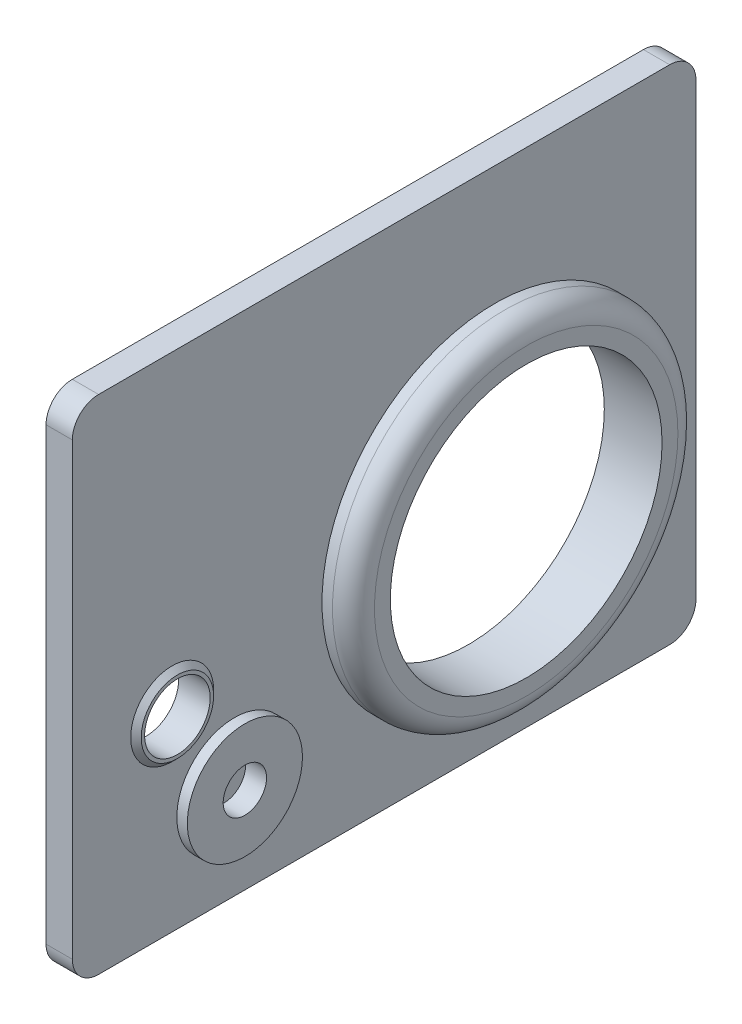
ISO-10303-21;
HEADER;
FILE_DESCRIPTION(('STEP AP214'),'2;1');
FILE_NAME('part.step','',(''),(''),'','','');
FILE_SCHEMA(('AUTOMOTIVE_DESIGN { 1 0 10303 214 1 1 1 1 }'));
ENDSEC;
DATA;
#1=APPLICATION_CONTEXT('core data for automotive mechanical design processes');
#2=APPLICATION_PROTOCOL_DEFINITION('international standard','automotive_design',2000,#1);
#3=PRODUCT_CONTEXT('',#1,'mechanical');
#4=PRODUCT('Part','Part','',(#3));
#5=PRODUCT_RELATED_PRODUCT_CATEGORY('part','',(#4));
#6=PRODUCT_DEFINITION_FORMATION('','',#4);
#7=PRODUCT_DEFINITION_CONTEXT('part definition',#1,'design');
#8=PRODUCT_DEFINITION('design','',#6,#7);
#9=PRODUCT_DEFINITION_SHAPE('','',#8);
#10=(LENGTH_UNIT() NAMED_UNIT(*) SI_UNIT(.MILLI.,.METRE.));
#11=(NAMED_UNIT(*) PLANE_ANGLE_UNIT() SI_UNIT($,.RADIAN.));
#12=(NAMED_UNIT(*) SI_UNIT($,.STERADIAN.) SOLID_ANGLE_UNIT());
#13=UNCERTAINTY_MEASURE_WITH_UNIT(LENGTH_MEASURE(1.E-05),#10,'distance_accuracy_value','');
#14=(GEOMETRIC_REPRESENTATION_CONTEXT(3) GLOBAL_UNCERTAINTY_ASSIGNED_CONTEXT((#13)) GLOBAL_UNIT_ASSIGNED_CONTEXT((#10,
#11,#12)) REPRESENTATION_CONTEXT('',''));
#15=CARTESIAN_POINT('',(0.,0.,0.));
#16=DIRECTION('',(0.,0.,1.));
#17=DIRECTION('',(1.,0.,0.));
#18=AXIS2_PLACEMENT_3D('',#15,#16,#17);
#19=CARTESIAN_POINT('',(5.,-47.8186465873431,0.));
#20=DIRECTION('',(0.,1.,0.));
#21=DIRECTION('',(0.,0.,1.));
#22=AXIS2_PLACEMENT_3D('',#19,#20,#21);
#23=PLANE('',#22);
#24=DIRECTION('',(0.,0.,-1.));
#25=VECTOR('',#24,1.);
#26=CARTESIAN_POINT('',(0.,-47.8186465873431,0.));
#27=LINE('',#26,#25);
#28=CARTESIAN_POINT('',(0.,-47.8186465873431,54.3691641496964));
#29=VERTEX_POINT('',#28);
#30=CARTESIAN_POINT('',(0.,-47.8186465873431,-54.3691641496964));
#31=VERTEX_POINT('',#30);
#32=EDGE_CURVE('E169',#29,#31,#27,.T.);
#33=ORIENTED_EDGE('',*,*,#32,.T.);
#34=DIRECTION('',(-1.,0.,0.));
#35=VECTOR('',#34,1.);
#36=CARTESIAN_POINT('',(5.,-47.8186465873431,-54.3691641496964));
#37=LINE('',#36,#35);
#38=CARTESIAN_POINT('',(5.,-47.8186465873431,-54.3691641496964));
#39=VERTEX_POINT('',#38);
#40=EDGE_CURVE('E154',#31,#39,#37,.F.);
#41=ORIENTED_EDGE('',*,*,#40,.T.);
#42=DIRECTION('',(0.,0.,-1.));
#43=VECTOR('',#42,1.);
#44=CARTESIAN_POINT('',(5.,-47.8186465873431,0.));
#45=LINE('',#44,#43);
#46=CARTESIAN_POINT('',(5.,-47.8186465873431,54.3691641496964));
#47=VERTEX_POINT('',#46);
#48=EDGE_CURVE('E212',#47,#39,#45,.T.);
#49=ORIENTED_EDGE('',*,*,#48,.F.);
#50=DIRECTION('',(-1.,0.,0.));
#51=VECTOR('',#50,1.);
#52=CARTESIAN_POINT('',(0.,-47.8186465873431,54.3691641496964));
#53=LINE('',#52,#51);
#54=EDGE_CURVE('E151',#47,#29,#53,.T.);
#55=ORIENTED_EDGE('',*,*,#54,.T.);
#56=EDGE_LOOP('',(#33,#41,#49,#55));
#57=FACE_BOUND('',#56,.T.);
#58=ADVANCED_FACE('F39',(#57),#23,.F.);
#59=CARTESIAN_POINT('',(5.,0.,-59.3691641496964));
#60=DIRECTION('',(0.,0.,1.));
#61=DIRECTION('',(1.,0.,0.));
#62=AXIS2_PLACEMENT_3D('',#59,#60,#61);
#63=PLANE('',#62);
#64=DIRECTION('',(0.,1.,0.));
#65=VECTOR('',#64,1.);
#66=CARTESIAN_POINT('',(0.,0.,-59.3691641496964));
#67=LINE('',#66,#65);
#68=CARTESIAN_POINT('',(0.,-42.8186465873431,-59.3691641496964));
#69=VERTEX_POINT('',#68);
#70=CARTESIAN_POINT('',(0.,42.8186465873431,-59.3691641496964));
#71=VERTEX_POINT('',#70);
#72=EDGE_CURVE('E124',#69,#71,#67,.T.);
#73=ORIENTED_EDGE('',*,*,#72,.T.);
#74=DIRECTION('',(-1.,0.,0.));
#75=VECTOR('',#74,1.);
#76=CARTESIAN_POINT('',(5.,42.8186465873431,-59.3691641496964));
#77=LINE('',#76,#75);
#78=CARTESIAN_POINT('',(5.,42.8186465873431,-59.3691641496964));
#79=VERTEX_POINT('',#78);
#80=EDGE_CURVE('E142',#71,#79,#77,.F.);
#81=ORIENTED_EDGE('',*,*,#80,.T.);
#82=DIRECTION('',(0.,1.,0.));
#83=VECTOR('',#82,1.);
#84=CARTESIAN_POINT('',(5.,0.,-59.3691641496964));
#85=LINE('',#84,#83);
#86=CARTESIAN_POINT('',(5.,-42.8186465873431,-59.3691641496964));
#87=VERTEX_POINT('',#86);
#88=EDGE_CURVE('E165',#87,#79,#85,.T.);
#89=ORIENTED_EDGE('',*,*,#88,.F.);
#90=DIRECTION('',(-1.,0.,0.));
#91=VECTOR('',#90,1.);
#92=CARTESIAN_POINT('',(5.,-42.8186465873431,-59.3691641496964));
#93=LINE('',#92,#91);
#94=EDGE_CURVE('E139',#87,#69,#93,.T.);
#95=ORIENTED_EDGE('',*,*,#94,.T.);
#96=EDGE_LOOP('',(#73,#81,#89,#95));
#97=FACE_BOUND('',#96,.T.);
#98=ADVANCED_FACE('F225',(#97),#63,.F.);
#99=CARTESIAN_POINT('',(5.,47.8186465873431,0.));
#100=DIRECTION('',(0.,1.,0.));
#101=DIRECTION('',(0.,0.,1.));
#102=AXIS2_PLACEMENT_3D('',#99,#100,#101);
#103=PLANE('',#102);
#104=DIRECTION('',(0.,0.,-1.));
#105=VECTOR('',#104,1.);
#106=CARTESIAN_POINT('',(5.,47.8186465873431,0.));
#107=LINE('',#106,#105);
#108=CARTESIAN_POINT('',(5.,47.8186465873431,54.3691641496964));
#109=VERTEX_POINT('',#108);
#110=CARTESIAN_POINT('',(5.,47.8186465873431,-54.3691641496964));
#111=VERTEX_POINT('',#110);
#112=EDGE_CURVE('E161',#109,#111,#107,.T.);
#113=ORIENTED_EDGE('',*,*,#112,.T.);
#114=DIRECTION('',(-1.,0.,0.));
#115=VECTOR('',#114,1.);
#116=CARTESIAN_POINT('',(0.,47.8186465873431,-54.3691641496964));
#117=LINE('',#116,#115);
#118=CARTESIAN_POINT('',(0.,47.8186465873431,-54.3691641496964));
#119=VERTEX_POINT('',#118);
#120=EDGE_CURVE('E116',#111,#119,#117,.T.);
#121=ORIENTED_EDGE('',*,*,#120,.T.);
#122=DIRECTION('',(0.,0.,-1.));
#123=VECTOR('',#122,1.);
#124=CARTESIAN_POINT('',(0.,47.8186465873431,0.));
#125=LINE('',#124,#123);
#126=CARTESIAN_POINT('',(0.,47.8186465873431,54.3691641496964));
#127=VERTEX_POINT('',#126);
#128=EDGE_CURVE('E109',#127,#119,#125,.T.);
#129=ORIENTED_EDGE('',*,*,#128,.F.);
#130=DIRECTION('',(-1.,0.,0.));
#131=VECTOR('',#130,1.);
#132=CARTESIAN_POINT('',(5.,47.8186465873431,54.3691641496964));
#133=LINE('',#132,#131);
#134=EDGE_CURVE('E122',#127,#109,#133,.F.);
#135=ORIENTED_EDGE('',*,*,#134,.T.);
#136=EDGE_LOOP('',(#113,#121,#129,#135));
#137=FACE_BOUND('',#136,.T.);
#138=ADVANCED_FACE('F121',(#137),#103,.T.);
#139=CARTESIAN_POINT('',(5.,0.,59.3691641496964));
#140=DIRECTION('',(0.,0.,1.));
#141=DIRECTION('',(1.,0.,0.));
#142=AXIS2_PLACEMENT_3D('',#139,#140,#141);
#143=PLANE('',#142);
#144=DIRECTION('',(0.,1.,0.));
#145=VECTOR('',#144,1.);
#146=CARTESIAN_POINT('',(0.,0.,59.3691641496964));
#147=LINE('',#146,#145);
#148=CARTESIAN_POINT('',(0.,-42.8186465873431,59.3691641496964));
#149=VERTEX_POINT('',#148);
#150=CARTESIAN_POINT('',(0.,42.8186465873431,59.3691641496964));
#151=VERTEX_POINT('',#150);
#152=EDGE_CURVE('E110',#149,#151,#147,.T.);
#153=ORIENTED_EDGE('',*,*,#152,.F.);
#154=DIRECTION('',(-1.,0.,0.));
#155=VECTOR('',#154,1.);
#156=CARTESIAN_POINT('',(5.,-42.8186465873431,59.3691641496964));
#157=LINE('',#156,#155);
#158=CARTESIAN_POINT('',(5.,-42.8186465873431,59.3691641496964));
#159=VERTEX_POINT('',#158);
#160=EDGE_CURVE('E47',#149,#159,#157,.F.);
#161=ORIENTED_EDGE('',*,*,#160,.T.);
#162=DIRECTION('',(0.,1.,0.));
#163=VECTOR('',#162,1.);
#164=CARTESIAN_POINT('',(5.,0.,59.3691641496964));
#165=LINE('',#164,#163);
#166=CARTESIAN_POINT('',(5.,42.8186465873431,59.3691641496964));
#167=VERTEX_POINT('',#166);
#168=EDGE_CURVE('E158',#159,#167,#165,.T.);
#169=ORIENTED_EDGE('',*,*,#168,.T.);
#170=DIRECTION('',(-1.,0.,0.));
#171=VECTOR('',#170,1.);
#172=CARTESIAN_POINT('',(5.,42.8186465873431,59.3691641496964));
#173=LINE('',#172,#171);
#174=EDGE_CURVE('E156',#167,#151,#173,.T.);
#175=ORIENTED_EDGE('',*,*,#174,.T.);
#176=EDGE_LOOP('',(#153,#161,#169,#175));
#177=FACE_BOUND('',#176,.T.);
#178=ADVANCED_FACE('F157',(#177),#143,.T.);
#179=CARTESIAN_POINT('',(5.,0.,0.));
#180=DIRECTION('',(1.,0.,0.));
#181=DIRECTION('',(0.,0.,-1.));
#182=AXIS2_PLACEMENT_3D('',#179,#180,#181);
#183=PLANE('',#182);
#184=CARTESIAN_POINT('',(5.,-11.8260503050656,40.36330842923));
#185=DIRECTION('',(1.,0.,0.));
#186=DIRECTION('',(0.,0.,-1.));
#187=AXIS2_PLACEMENT_3D('',#184,#185,#186);
#188=CIRCLE('',#187,7.89482941746761);
#189=CARTESIAN_POINT('',(5.,-11.8260503050656,32.4684790117624));
#190=VERTEX_POINT('',#189);
#191=EDGE_CURVE('E175',#190,#190,#188,.T.);
#192=ORIENTED_EDGE('',*,*,#191,.F.);
#193=EDGE_LOOP('',(#192));
#194=FACE_BOUND('',#193,.T.);
#195=CARTESIAN_POINT('',(5.,-29.366301205693,28.5136729808346));
#196=DIRECTION('',(1.,0.,0.));
#197=DIRECTION('',(0.,0.,-1.));
#198=AXIS2_PLACEMENT_3D('',#195,#196,#197);
#199=CIRCLE('',#198,10.9631180729096);
#200=CARTESIAN_POINT('',(5.,-29.366301205693,17.5505549079249));
#201=VERTEX_POINT('',#200);
#202=EDGE_CURVE('E206',#201,#201,#199,.T.);
#203=ORIENTED_EDGE('',*,*,#202,.F.);
#204=EDGE_LOOP('',(#203));
#205=FACE_BOUND('',#204,.T.);
#206=CARTESIAN_POINT('',(5.,-7.78250118211528,-21.052704773187));
#207=DIRECTION('',(1.,0.,0.));
#208=DIRECTION('',(0.,0.,-1.));
#209=AXIS2_PLACEMENT_3D('',#206,#207,#208);
#210=CIRCLE('',#209,32.8876083466299);
#211=CARTESIAN_POINT('',(5.,-7.78250118211528,-53.9403131198169));
#212=VERTEX_POINT('',#211);
#213=EDGE_CURVE('E209',#212,#212,#210,.T.);
#214=ORIENTED_EDGE('',*,*,#213,.F.);
#215=EDGE_LOOP('',(#214));
#216=FACE_BOUND('',#215,.T.);
#217=ORIENTED_EDGE('',*,*,#88,.T.);
#218=CARTESIAN_POINT('',(5.,42.8186465873431,-54.3691641496964));
#219=DIRECTION('',(1.,0.,0.));
#220=DIRECTION('',(0.,0.,-1.));
#221=AXIS2_PLACEMENT_3D('',#218,#219,#220);
#222=CIRCLE('',#221,5.);
#223=EDGE_CURVE('E149',#79,#111,#222,.T.);
#224=ORIENTED_EDGE('',*,*,#223,.T.);
#225=ORIENTED_EDGE('',*,*,#112,.F.);
#226=CARTESIAN_POINT('',(5.,42.8186465873431,54.3691641496964));
#227=DIRECTION('',(1.,0.,0.));
#228=DIRECTION('',(0.,0.,-1.));
#229=AXIS2_PLACEMENT_3D('',#226,#227,#228);
#230=CIRCLE('',#229,5.);
#231=EDGE_CURVE('E54',#109,#167,#230,.T.);
#232=ORIENTED_EDGE('',*,*,#231,.T.);
#233=ORIENTED_EDGE('',*,*,#168,.F.);
#234=CARTESIAN_POINT('',(5.,-42.8186465873431,54.3691641496964));
#235=DIRECTION('',(1.,0.,0.));
#236=DIRECTION('',(0.,0.,-1.));
#237=AXIS2_PLACEMENT_3D('',#234,#235,#236);
#238=CIRCLE('',#237,5.);
#239=EDGE_CURVE('E145',#159,#47,#238,.T.);
#240=ORIENTED_EDGE('',*,*,#239,.T.);
#241=ORIENTED_EDGE('',*,*,#48,.T.);
#242=CARTESIAN_POINT('',(5.,-42.8186465873431,-54.3691641496964));
#243=DIRECTION('',(1.,0.,0.));
#244=DIRECTION('',(0.,0.,-1.));
#245=AXIS2_PLACEMENT_3D('',#242,#243,#244);
#246=CIRCLE('',#245,5.);
#247=EDGE_CURVE('E147',#39,#87,#246,.T.);
#248=ORIENTED_EDGE('',*,*,#247,.T.);
#249=EDGE_LOOP('',(#217,#224,#225,#232,#233,#240,#241,#248));
#250=FACE_BOUND('',#249,.T.);
#251=ADVANCED_FACE('F217',(#194,#205,#216,#250),#183,.T.);
#252=CARTESIAN_POINT('',(0.,0.,0.));
#253=DIRECTION('',(1.,0.,0.));
#254=DIRECTION('',(0.,0.,-1.));
#255=AXIS2_PLACEMENT_3D('',#252,#253,#254);
#256=PLANE('',#255);
#257=ORIENTED_EDGE('',*,*,#128,.T.);
#258=CARTESIAN_POINT('',(0.,42.8186465873431,-54.3691641496964));
#259=DIRECTION('',(1.,0.,0.));
#260=DIRECTION('',(0.,0.,-1.));
#261=AXIS2_PLACEMENT_3D('',#258,#259,#260);
#262=CIRCLE('',#261,5.);
#263=EDGE_CURVE('E137',#119,#71,#262,.F.);
#264=ORIENTED_EDGE('',*,*,#263,.T.);
#265=ORIENTED_EDGE('',*,*,#72,.F.);
#266=CARTESIAN_POINT('',(0.,-42.8186465873431,-54.3691641496964));
#267=DIRECTION('',(1.,0.,0.));
#268=DIRECTION('',(0.,0.,-1.));
#269=AXIS2_PLACEMENT_3D('',#266,#267,#268);
#270=CIRCLE('',#269,5.);
#271=EDGE_CURVE('E135',#69,#31,#270,.F.);
#272=ORIENTED_EDGE('',*,*,#271,.T.);
#273=ORIENTED_EDGE('',*,*,#32,.F.);
#274=CARTESIAN_POINT('',(0.,-42.8186465873431,54.3691641496964));
#275=DIRECTION('',(1.,0.,0.));
#276=DIRECTION('',(0.,0.,-1.));
#277=AXIS2_PLACEMENT_3D('',#274,#275,#276);
#278=CIRCLE('',#277,5.);
#279=EDGE_CURVE('E115',#29,#149,#278,.F.);
#280=ORIENTED_EDGE('',*,*,#279,.T.);
#281=ORIENTED_EDGE('',*,*,#152,.T.);
#282=CARTESIAN_POINT('',(0.,42.8186465873431,54.3691641496964));
#283=DIRECTION('',(1.,0.,0.));
#284=DIRECTION('',(0.,0.,-1.));
#285=AXIS2_PLACEMENT_3D('',#282,#283,#284);
#286=CIRCLE('',#285,5.);
#287=EDGE_CURVE('E105',#151,#127,#286,.F.);
#288=ORIENTED_EDGE('',*,*,#287,.T.);
#289=EDGE_LOOP('',(#257,#264,#265,#272,#273,#280,#281,#288));
#290=FACE_BOUND('',#289,.T.);
#291=CARTESIAN_POINT('',(0.,-7.78250118211528,-21.052704773187));
#292=DIRECTION('',(1.,0.,0.));
#293=DIRECTION('',(0.,0.,-1.));
#294=AXIS2_PLACEMENT_3D('',#291,#292,#293);
#295=CIRCLE('',#294,25.8690409108859);
#296=CARTESIAN_POINT('',(0.,-7.78250118211528,-46.9217456840729));
#297=VERTEX_POINT('',#296);
#298=EDGE_CURVE('E196',#297,#297,#295,.T.);
#299=ORIENTED_EDGE('',*,*,#298,.T.);
#300=EDGE_LOOP('',(#299));
#301=FACE_BOUND('',#300,.T.);
#302=CARTESIAN_POINT('',(0.,-11.8260503050656,40.36330842923));
#303=DIRECTION('',(1.,0.,0.));
#304=DIRECTION('',(0.,0.,-1.));
#305=AXIS2_PLACEMENT_3D('',#302,#303,#304);
#306=CIRCLE('',#305,6.24360587541227);
#307=CARTESIAN_POINT('',(0.,-11.8260503050656,34.1197025538178));
#308=VERTEX_POINT('',#307);
#309=EDGE_CURVE('E455',#308,#308,#306,.T.);
#310=ORIENTED_EDGE('',*,*,#309,.T.);
#311=EDGE_LOOP('',(#310));
#312=FACE_BOUND('',#311,.T.);
#313=ADVANCED_FACE('F107',(#290,#301,#312),#256,.F.);
#314=CARTESIAN_POINT('',(11.,-7.78250118211528,-21.052704773187));
#315=DIRECTION('',(-1.,0.,0.));
#316=DIRECTION('',(0.,0.,1.));
#317=AXIS2_PLACEMENT_3D('',#314,#315,#316);
#318=CYLINDRICAL_SURFACE('',#317,25.8690409108859);
#319=CARTESIAN_POINT('',(11.,-7.78250118211528,-21.052704773187));
#320=DIRECTION('',(1.,0.,0.));
#321=DIRECTION('',(0.,0.,-1.));
#322=AXIS2_PLACEMENT_3D('',#319,#320,#321);
#323=CIRCLE('',#322,25.8690409108859);
#324=CARTESIAN_POINT('',(11.,-7.78250118211528,-46.9217456840729));
#325=VERTEX_POINT('',#324);
#326=EDGE_CURVE('E172',#325,#325,#323,.T.);
#327=ORIENTED_EDGE('',*,*,#326,.T.);
#328=EDGE_LOOP('',(#327));
#329=FACE_BOUND('',#328,.T.);
#330=ORIENTED_EDGE('',*,*,#298,.F.);
#331=EDGE_LOOP('',(#330));
#332=FACE_BOUND('',#331,.T.);
#333=ADVANCED_FACE('F286',(#329,#332),#318,.F.);
#334=CARTESIAN_POINT('',(11.,-7.78250118211528,-21.052704773187));
#335=DIRECTION('',(-1.,0.,0.));
#336=DIRECTION('',(0.,0.,1.));
#337=AXIS2_PLACEMENT_3D('',#334,#335,#336);
#338=CYLINDRICAL_SURFACE('',#337,32.8876083466299);
#339=CARTESIAN_POINT('',(7.,-7.78250118211528,-21.052704773187));
#340=DIRECTION('',(1.,0.,0.));
#341=DIRECTION('',(0.,0.,-1.));
#342=AXIS2_PLACEMENT_3D('',#339,#340,#341);
#343=CIRCLE('',#342,32.8876083466299);
#344=CARTESIAN_POINT('',(7.,-7.78250118211528,-53.9403131198169));
#345=VERTEX_POINT('',#344);
#346=EDGE_CURVE('E130',#345,#345,#343,.F.);
#347=ORIENTED_EDGE('',*,*,#346,.T.);
#348=EDGE_LOOP('',(#347));
#349=FACE_BOUND('',#348,.T.);
#350=ORIENTED_EDGE('',*,*,#213,.T.);
#351=EDGE_LOOP('',(#350));
#352=FACE_BOUND('',#351,.T.);
#353=ADVANCED_FACE('F179',(#349,#352),#338,.T.);
#354=CARTESIAN_POINT('',(11.,0.,0.));
#355=DIRECTION('',(1.,0.,0.));
#356=DIRECTION('',(0.,0.,-1.));
#357=AXIS2_PLACEMENT_3D('',#354,#355,#356);
#358=PLANE('',#357);
#359=CARTESIAN_POINT('',(11.,-7.78250118211528,-21.052704773187));
#360=DIRECTION('',(1.,0.,0.));
#361=DIRECTION('',(0.,0.,-1.));
#362=AXIS2_PLACEMENT_3D('',#359,#360,#361);
#363=CIRCLE('',#362,28.8876083466299);
#364=CARTESIAN_POINT('',(11.,-7.78250118211528,-49.9403131198169));
#365=VERTEX_POINT('',#364);
#366=EDGE_CURVE('E160',#365,#365,#363,.T.);
#367=ORIENTED_EDGE('',*,*,#366,.T.);
#368=EDGE_LOOP('',(#367));
#369=FACE_BOUND('',#368,.T.);
#370=ORIENTED_EDGE('',*,*,#326,.F.);
#371=EDGE_LOOP('',(#370));
#372=FACE_BOUND('',#371,.T.);
#373=ADVANCED_FACE('F186',(#369,#372),#358,.T.);
#374=CARTESIAN_POINT('',(7.,-7.78250118211528,-21.052704773187));
#375=DIRECTION('',(1.,0.,0.));
#376=DIRECTION('',(0.,0.,-1.));
#377=AXIS2_PLACEMENT_3D('',#374,#375,#376);
#378=TOROIDAL_SURFACE('',#377,28.8876083466299,4.);
#379=ORIENTED_EDGE('',*,*,#346,.F.);
#380=EDGE_LOOP('',(#379));
#381=FACE_BOUND('',#380,.T.);
#382=ORIENTED_EDGE('',*,*,#366,.F.);
#383=EDGE_LOOP('',(#382));
#384=FACE_BOUND('',#383,.T.);
#385=ADVANCED_FACE('F182',(#381,#384),#378,.T.);
#386=CARTESIAN_POINT('',(7.,-29.366301205693,28.5136729808346));
#387=DIRECTION('',(-1.,0.,0.));
#388=DIRECTION('',(0.,0.,1.));
#389=AXIS2_PLACEMENT_3D('',#386,#387,#388);
#390=CYLINDRICAL_SURFACE('',#389,4.13060626055679);
#391=CARTESIAN_POINT('',(3.,-29.366301205693,28.5136729808346));
#392=DIRECTION('',(1.,0.,0.));
#393=DIRECTION('',(0.,0.,-1.));
#394=AXIS2_PLACEMENT_3D('',#391,#392,#393);
#395=CIRCLE('',#394,4.13060626055679);
#396=CARTESIAN_POINT('',(3.,-29.366301205693,24.3830667202778));
#397=VERTEX_POINT('',#396);
#398=EDGE_CURVE('E11',#397,#397,#395,.T.);
#399=ORIENTED_EDGE('',*,*,#398,.F.);
#400=EDGE_LOOP('',(#399));
#401=FACE_BOUND('',#400,.T.);
#402=CARTESIAN_POINT('',(7.,-29.366301205693,28.5136729808346));
#403=DIRECTION('',(1.,0.,0.));
#404=DIRECTION('',(0.,0.,-1.));
#405=AXIS2_PLACEMENT_3D('',#402,#403,#404);
#406=CIRCLE('',#405,4.13060626055679);
#407=CARTESIAN_POINT('',(7.,-29.366301205693,24.3830667202778));
#408=VERTEX_POINT('',#407);
#409=EDGE_CURVE('E449',#408,#408,#406,.T.);
#410=ORIENTED_EDGE('',*,*,#409,.T.);
#411=EDGE_LOOP('',(#410));
#412=FACE_BOUND('',#411,.T.);
#413=ADVANCED_FACE('F185',(#401,#412),#390,.F.);
#414=CARTESIAN_POINT('',(7.,-29.366301205693,28.5136729808346));
#415=DIRECTION('',(-1.,0.,0.));
#416=DIRECTION('',(0.,0.,1.));
#417=AXIS2_PLACEMENT_3D('',#414,#415,#416);
#418=CYLINDRICAL_SURFACE('',#417,10.9631180729096);
#419=ORIENTED_EDGE('',*,*,#202,.T.);
#420=EDGE_LOOP('',(#419));
#421=FACE_BOUND('',#420,.T.);
#422=CARTESIAN_POINT('',(7.,-29.366301205693,28.5136729808346));
#423=DIRECTION('',(1.,0.,0.));
#424=DIRECTION('',(0.,0.,-1.));
#425=AXIS2_PLACEMENT_3D('',#422,#423,#424);
#426=CIRCLE('',#425,10.9631180729096);
#427=CARTESIAN_POINT('',(7.,-29.366301205693,17.5505549079249));
#428=VERTEX_POINT('',#427);
#429=EDGE_CURVE('E199',#428,#428,#426,.T.);
#430=ORIENTED_EDGE('',*,*,#429,.F.);
#431=EDGE_LOOP('',(#430));
#432=FACE_BOUND('',#431,.T.);
#433=ADVANCED_FACE('F299',(#421,#432),#418,.T.);
#434=CARTESIAN_POINT('',(7.,0.,0.));
#435=DIRECTION('',(1.,0.,0.));
#436=DIRECTION('',(0.,0.,-1.));
#437=AXIS2_PLACEMENT_3D('',#434,#435,#436);
#438=PLANE('',#437);
#439=ORIENTED_EDGE('',*,*,#409,.F.);
#440=EDGE_LOOP('',(#439));
#441=FACE_BOUND('',#440,.T.);
#442=ORIENTED_EDGE('',*,*,#429,.T.);
#443=EDGE_LOOP('',(#442));
#444=FACE_BOUND('',#443,.T.);
#445=ADVANCED_FACE('F320',(#441,#444),#438,.T.);
#446=CARTESIAN_POINT('',(6.,-11.8260503050656,40.36330842923));
#447=DIRECTION('',(-1.,0.,0.));
#448=DIRECTION('',(0.,0.,1.));
#449=AXIS2_PLACEMENT_3D('',#446,#447,#448);
#450=CYLINDRICAL_SURFACE('',#449,6.24360587541227);
#451=CARTESIAN_POINT('',(6.,-11.8260503050656,40.36330842923));
#452=DIRECTION('',(1.,0.,0.));
#453=DIRECTION('',(0.,0.,-1.));
#454=AXIS2_PLACEMENT_3D('',#451,#452,#453);
#455=CIRCLE('',#454,6.24360587541227);
#456=CARTESIAN_POINT('',(6.,-11.8260503050656,34.1197025538178));
#457=VERTEX_POINT('',#456);
#458=EDGE_CURVE('E451',#457,#457,#455,.T.);
#459=ORIENTED_EDGE('',*,*,#458,.T.);
#460=EDGE_LOOP('',(#459));
#461=FACE_BOUND('',#460,.T.);
#462=ORIENTED_EDGE('',*,*,#309,.F.);
#463=EDGE_LOOP('',(#462));
#464=FACE_BOUND('',#463,.T.);
#465=ADVANCED_FACE('F316',(#461,#464),#450,.F.);
#466=CARTESIAN_POINT('',(6.,0.,0.));
#467=DIRECTION('',(1.,0.,0.));
#468=DIRECTION('',(0.,0.,-1.));
#469=AXIS2_PLACEMENT_3D('',#466,#467,#468);
#470=PLANE('',#469);
#471=CARTESIAN_POINT('',(6.,-11.8260503050656,40.36330842923));
#472=DIRECTION('',(1.,0.,0.));
#473=DIRECTION('',(0.,0.,-1.));
#474=AXIS2_PLACEMENT_3D('',#471,#472,#473);
#475=CIRCLE('',#474,6.89482941746761);
#476=CARTESIAN_POINT('',(6.,-11.8260503050656,33.4684790117624));
#477=VERTEX_POINT('',#476);
#478=EDGE_CURVE('E126',#477,#477,#475,.T.);
#479=ORIENTED_EDGE('',*,*,#478,.T.);
#480=EDGE_LOOP('',(#479));
#481=FACE_BOUND('',#480,.T.);
#482=ORIENTED_EDGE('',*,*,#458,.F.);
#483=EDGE_LOOP('',(#482));
#484=FACE_BOUND('',#483,.T.);
#485=ADVANCED_FACE('F253',(#481,#484),#470,.T.);
#486=CARTESIAN_POINT('',(6.,-11.8260503050656,40.36330842923));
#487=DIRECTION('',(-1.,0.,0.));
#488=DIRECTION('',(0.,0.,1.));
#489=AXIS2_PLACEMENT_3D('',#486,#487,#488);
#490=CONICAL_SURFACE('',#489,6.89482941746761,0.785398163397435);
#491=ORIENTED_EDGE('',*,*,#191,.T.);
#492=EDGE_LOOP('',(#491));
#493=FACE_BOUND('',#492,.T.);
#494=ORIENTED_EDGE('',*,*,#478,.F.);
#495=EDGE_LOOP('',(#494));
#496=FACE_BOUND('',#495,.T.);
#497=ADVANCED_FACE('F250',(#493,#496),#490,.T.);
#498=CARTESIAN_POINT('',(5.,42.8186465873431,-54.3691641496964));
#499=DIRECTION('',(1.,0.,0.));
#500=DIRECTION('',(0.,0.,-1.));
#501=AXIS2_PLACEMENT_3D('',#498,#499,#500);
#502=CYLINDRICAL_SURFACE('',#501,5.);
#503=ORIENTED_EDGE('',*,*,#223,.F.);
#504=ORIENTED_EDGE('',*,*,#80,.F.);
#505=ORIENTED_EDGE('',*,*,#263,.F.);
#506=ORIENTED_EDGE('',*,*,#120,.F.);
#507=EDGE_LOOP('',(#503,#504,#505,#506));
#508=FACE_BOUND('',#507,.T.);
#509=ADVANCED_FACE('F223',(#508),#502,.T.);
#510=CARTESIAN_POINT('',(5.,-42.8186465873431,-54.3691641496964));
#511=DIRECTION('',(-1.,0.,0.));
#512=DIRECTION('',(0.,0.,1.));
#513=AXIS2_PLACEMENT_3D('',#510,#511,#512);
#514=CYLINDRICAL_SURFACE('',#513,5.);
#515=ORIENTED_EDGE('',*,*,#247,.F.);
#516=ORIENTED_EDGE('',*,*,#40,.F.);
#517=ORIENTED_EDGE('',*,*,#271,.F.);
#518=ORIENTED_EDGE('',*,*,#94,.F.);
#519=EDGE_LOOP('',(#515,#516,#517,#518));
#520=FACE_BOUND('',#519,.T.);
#521=ADVANCED_FACE('F227',(#520),#514,.T.);
#522=CARTESIAN_POINT('',(5.,-42.8186465873431,54.3691641496964));
#523=DIRECTION('',(1.,0.,0.));
#524=DIRECTION('',(0.,0.,-1.));
#525=AXIS2_PLACEMENT_3D('',#522,#523,#524);
#526=CYLINDRICAL_SURFACE('',#525,5.);
#527=ORIENTED_EDGE('',*,*,#239,.F.);
#528=ORIENTED_EDGE('',*,*,#160,.F.);
#529=ORIENTED_EDGE('',*,*,#279,.F.);
#530=ORIENTED_EDGE('',*,*,#54,.F.);
#531=EDGE_LOOP('',(#527,#528,#529,#530));
#532=FACE_BOUND('',#531,.T.);
#533=ADVANCED_FACE('F234',(#532),#526,.T.);
#534=CARTESIAN_POINT('',(5.,42.8186465873431,54.3691641496964));
#535=DIRECTION('',(-1.,0.,0.));
#536=DIRECTION('',(0.,0.,1.));
#537=AXIS2_PLACEMENT_3D('',#534,#535,#536);
#538=CYLINDRICAL_SURFACE('',#537,5.);
#539=ORIENTED_EDGE('',*,*,#231,.F.);
#540=ORIENTED_EDGE('',*,*,#134,.F.);
#541=ORIENTED_EDGE('',*,*,#287,.F.);
#542=ORIENTED_EDGE('',*,*,#174,.F.);
#543=EDGE_LOOP('',(#539,#540,#541,#542));
#544=FACE_BOUND('',#543,.T.);
#545=ADVANCED_FACE('F41',(#544),#538,.T.);
#546=CARTESIAN_POINT('',(3.,-29.366301205693,28.5136729808346));
#547=DIRECTION('',(1.,0.,0.));
#548=DIRECTION('',(0.,0.,-1.));
#549=AXIS2_PLACEMENT_3D('',#546,#547,#548);
#550=PLANE('',#549);
#551=ORIENTED_EDGE('',*,*,#398,.T.);
#552=EDGE_LOOP('',(#551));
#553=FACE_BOUND('',#552,.T.);
#554=ADVANCED_FACE('F240',(#553),#550,.T.);
#555=CLOSED_SHELL('',(#58,#98,#138,#178,#251,#313,#333,#353,#373,#385,#413,#433,#445,#465,#485,
#497,#509,#521,#533,#545,#554));
#556=MANIFOLD_SOLID_BREP('B2',#555);
#557=ADVANCED_BREP_SHAPE_REPRESENTATION('',(#18,#556),#14);
#558=SHAPE_DEFINITION_REPRESENTATION(#9,#557);
ENDSEC;
END-ISO-10303-21;
